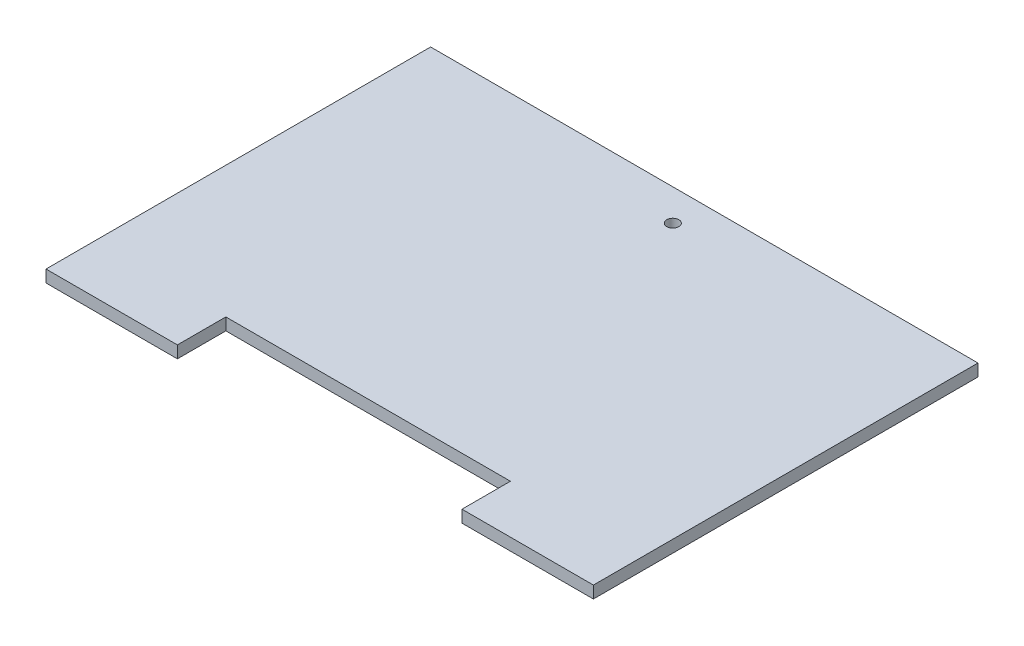
ISO-10303-21;
HEADER;
FILE_DESCRIPTION(('STEP AP214'),'2;1');
FILE_NAME('part.step','',(''),(''),'','','');
FILE_SCHEMA(('AUTOMOTIVE_DESIGN { 1 0 10303 214 1 1 1 1 }'));
ENDSEC;
DATA;
#1=APPLICATION_CONTEXT('core data for automotive mechanical design processes');
#2=APPLICATION_PROTOCOL_DEFINITION('international standard','automotive_design',2000,#1);
#3=PRODUCT_CONTEXT('',#1,'mechanical');
#4=PRODUCT('Part','Part','',(#3));
#5=PRODUCT_RELATED_PRODUCT_CATEGORY('part','',(#4));
#6=PRODUCT_DEFINITION_FORMATION('','',#4);
#7=PRODUCT_DEFINITION_CONTEXT('part definition',#1,'design');
#8=PRODUCT_DEFINITION('design','',#6,#7);
#9=PRODUCT_DEFINITION_SHAPE('','',#8);
#10=(LENGTH_UNIT() NAMED_UNIT(*) SI_UNIT(.MILLI.,.METRE.));
#11=(NAMED_UNIT(*) PLANE_ANGLE_UNIT() SI_UNIT($,.RADIAN.));
#12=(NAMED_UNIT(*) SI_UNIT($,.STERADIAN.) SOLID_ANGLE_UNIT());
#13=UNCERTAINTY_MEASURE_WITH_UNIT(LENGTH_MEASURE(1.E-05),#10,'distance_accuracy_value','');
#14=(GEOMETRIC_REPRESENTATION_CONTEXT(3) GLOBAL_UNCERTAINTY_ASSIGNED_CONTEXT((#13)) GLOBAL_UNIT_ASSIGNED_CONTEXT((#10,
#11,#12)) REPRESENTATION_CONTEXT('',''));
#15=CARTESIAN_POINT('',(0.,0.,0.));
#16=DIRECTION('',(0.,0.,1.));
#17=DIRECTION('',(1.,0.,0.));
#18=AXIS2_PLACEMENT_3D('',#15,#16,#17);
#19=CARTESIAN_POINT('',(-143.51,3.175,100.838));
#20=DIRECTION('',(0.,0.,-1.));
#21=DIRECTION('',(-1.,0.,0.));
#22=AXIS2_PLACEMENT_3D('',#19,#20,#21);
#23=PLANE('',#22);
#24=DIRECTION('',(1.,0.,0.));
#25=VECTOR('',#24,1.);
#26=CARTESIAN_POINT('',(-143.51,-3.175,100.838));
#27=LINE('',#26,#25);
#28=CARTESIAN_POINT('',(-143.51,-3.175,100.838));
#29=VERTEX_POINT('',#28);
#30=CARTESIAN_POINT('',(-74.6125,-3.175,100.838));
#31=VERTEX_POINT('',#30);
#32=EDGE_CURVE('E123',#29,#31,#27,.T.);
#33=ORIENTED_EDGE('',*,*,#32,.T.);
#34=DIRECTION('',(0.,1.,0.));
#35=VECTOR('',#34,1.);
#36=CARTESIAN_POINT('',(-74.6125,-3.175,100.838));
#37=LINE('',#36,#35);
#38=CARTESIAN_POINT('',(-74.6125,3.175,100.838));
#39=VERTEX_POINT('',#38);
#40=EDGE_CURVE('E151',#31,#39,#37,.T.);
#41=ORIENTED_EDGE('',*,*,#40,.T.);
#42=DIRECTION('',(1.,0.,0.));
#43=VECTOR('',#42,1.);
#44=CARTESIAN_POINT('',(-143.51,3.175,100.838));
#45=LINE('',#44,#43);
#46=CARTESIAN_POINT('',(-143.51,3.175,100.838));
#47=VERTEX_POINT('',#46);
#48=EDGE_CURVE('E135',#47,#39,#45,.T.);
#49=ORIENTED_EDGE('',*,*,#48,.F.);
#50=DIRECTION('',(0.,-1.,0.));
#51=VECTOR('',#50,1.);
#52=CARTESIAN_POINT('',(-143.51,3.175,100.838));
#53=LINE('',#52,#51);
#54=EDGE_CURVE('E134',#47,#29,#53,.T.);
#55=ORIENTED_EDGE('',*,*,#54,.T.);
#56=EDGE_LOOP('',(#33,#41,#49,#55));
#57=FACE_BOUND('',#56,.T.);
#58=ADVANCED_FACE('F34',(#57),#23,.F.);
#59=CARTESIAN_POINT('',(143.51,3.175,-100.838));
#60=DIRECTION('',(-1.,0.,0.));
#61=DIRECTION('',(0.,0.,1.));
#62=AXIS2_PLACEMENT_3D('',#59,#60,#61);
#63=PLANE('',#62);
#64=DIRECTION('',(0.,0.,-1.));
#65=VECTOR('',#64,1.);
#66=CARTESIAN_POINT('',(143.51,-3.175,-100.838));
#67=LINE('',#66,#65);
#68=CARTESIAN_POINT('',(143.51,-3.175,100.838));
#69=VERTEX_POINT('',#68);
#70=CARTESIAN_POINT('',(143.51,-3.175,-100.838));
#71=VERTEX_POINT('',#70);
#72=EDGE_CURVE('E122',#69,#71,#67,.T.);
#73=ORIENTED_EDGE('',*,*,#72,.T.);
#74=DIRECTION('',(0.,-1.,0.));
#75=VECTOR('',#74,1.);
#76=CARTESIAN_POINT('',(143.51,3.175,-100.838));
#77=LINE('',#76,#75);
#78=CARTESIAN_POINT('',(143.51,3.175,-100.838));
#79=VERTEX_POINT('',#78);
#80=EDGE_CURVE('E11',#79,#71,#77,.T.);
#81=ORIENTED_EDGE('',*,*,#80,.F.);
#82=DIRECTION('',(0.,0.,-1.));
#83=VECTOR('',#82,1.);
#84=CARTESIAN_POINT('',(143.51,3.175,-100.838));
#85=LINE('',#84,#83);
#86=CARTESIAN_POINT('',(143.51,3.175,100.838));
#87=VERTEX_POINT('',#86);
#88=EDGE_CURVE('E127',#87,#79,#85,.T.);
#89=ORIENTED_EDGE('',*,*,#88,.F.);
#90=DIRECTION('',(0.,-1.,0.));
#91=VECTOR('',#90,1.);
#92=CARTESIAN_POINT('',(143.51,3.175,100.838));
#93=LINE('',#92,#91);
#94=EDGE_CURVE('E132',#87,#69,#93,.T.);
#95=ORIENTED_EDGE('',*,*,#94,.T.);
#96=EDGE_LOOP('',(#73,#81,#89,#95));
#97=FACE_BOUND('',#96,.T.);
#98=ADVANCED_FACE('F36',(#97),#63,.F.);
#99=CARTESIAN_POINT('',(-143.51,3.175,-100.838));
#100=DIRECTION('',(0.,0.,1.));
#101=DIRECTION('',(1.,0.,0.));
#102=AXIS2_PLACEMENT_3D('',#99,#100,#101);
#103=PLANE('',#102);
#104=DIRECTION('',(-1.,0.,0.));
#105=VECTOR('',#104,1.);
#106=CARTESIAN_POINT('',(-143.51,-3.175,-100.838));
#107=LINE('',#106,#105);
#108=CARTESIAN_POINT('',(-143.51,-3.175,-100.838));
#109=VERTEX_POINT('',#108);
#110=EDGE_CURVE('E128',#71,#109,#107,.T.);
#111=ORIENTED_EDGE('',*,*,#110,.T.);
#112=DIRECTION('',(0.,-1.,0.));
#113=VECTOR('',#112,1.);
#114=CARTESIAN_POINT('',(-143.51,3.175,-100.838));
#115=LINE('',#114,#113);
#116=CARTESIAN_POINT('',(-143.51,3.175,-100.838));
#117=VERTEX_POINT('',#116);
#118=EDGE_CURVE('E43',#117,#109,#115,.T.);
#119=ORIENTED_EDGE('',*,*,#118,.F.);
#120=DIRECTION('',(-1.,0.,0.));
#121=VECTOR('',#120,1.);
#122=CARTESIAN_POINT('',(-143.51,3.175,-100.838));
#123=LINE('',#122,#121);
#124=EDGE_CURVE('E88',#79,#117,#123,.T.);
#125=ORIENTED_EDGE('',*,*,#124,.F.);
#126=ORIENTED_EDGE('',*,*,#80,.T.);
#127=EDGE_LOOP('',(#111,#119,#125,#126));
#128=FACE_BOUND('',#127,.T.);
#129=ADVANCED_FACE('F159',(#128),#103,.F.);
#130=CARTESIAN_POINT('',(-143.51,3.175,-100.838));
#131=DIRECTION('',(1.,0.,0.));
#132=DIRECTION('',(0.,0.,-1.));
#133=AXIS2_PLACEMENT_3D('',#130,#131,#132);
#134=PLANE('',#133);
#135=DIRECTION('',(0.,0.,1.));
#136=VECTOR('',#135,1.);
#137=CARTESIAN_POINT('',(-143.51,-3.175,-100.838));
#138=LINE('',#137,#136);
#139=EDGE_CURVE('E124',#109,#29,#138,.T.);
#140=ORIENTED_EDGE('',*,*,#139,.T.);
#141=ORIENTED_EDGE('',*,*,#54,.F.);
#142=DIRECTION('',(0.,0.,1.));
#143=VECTOR('',#142,1.);
#144=CARTESIAN_POINT('',(-143.51,3.175,-100.838));
#145=LINE('',#144,#143);
#146=EDGE_CURVE('E144',#117,#47,#145,.T.);
#147=ORIENTED_EDGE('',*,*,#146,.F.);
#148=ORIENTED_EDGE('',*,*,#118,.T.);
#149=EDGE_LOOP('',(#140,#141,#147,#148));
#150=FACE_BOUND('',#149,.T.);
#151=ADVANCED_FACE('F142',(#150),#134,.F.);
#152=CARTESIAN_POINT('',(74.6125,3.175,100.838));
#153=VERTEX_POINT('',#152);
#154=EDGE_CURVE('E59',#153,#87,#45,.T.);
#155=ORIENTED_EDGE('',*,*,#154,.F.);
#156=DIRECTION('',(0.,1.,0.));
#157=VECTOR('',#156,1.);
#158=CARTESIAN_POINT('',(74.6125,-3.175,100.838));
#159=LINE('',#158,#157);
#160=CARTESIAN_POINT('',(74.6125,-3.175,100.838));
#161=VERTEX_POINT('',#160);
#162=EDGE_CURVE('E112',#161,#153,#159,.T.);
#163=ORIENTED_EDGE('',*,*,#162,.F.);
#164=EDGE_CURVE('E81',#161,#69,#27,.T.);
#165=ORIENTED_EDGE('',*,*,#164,.T.);
#166=ORIENTED_EDGE('',*,*,#94,.F.);
#167=EDGE_LOOP('',(#155,#163,#165,#166));
#168=FACE_BOUND('',#167,.T.);
#169=ADVANCED_FACE('F116',(#168),#23,.F.);
#170=CARTESIAN_POINT('',(0.,3.175,0.));
#171=DIRECTION('',(0.,1.,0.));
#172=DIRECTION('',(0.,0.,1.));
#173=AXIS2_PLACEMENT_3D('',#170,#171,#172);
#174=PLANE('',#173);
#175=CARTESIAN_POINT('',(0.,3.175,-84.328));
#176=DIRECTION('',(0.,-1.,0.));
#177=DIRECTION('',(0.,0.,-1.));
#178=AXIS2_PLACEMENT_3D('',#175,#176,#177);
#179=CIRCLE('',#178,3.175);
#180=CARTESIAN_POINT('',(0.,3.175,-87.503));
#181=VERTEX_POINT('',#180);
#182=EDGE_CURVE('E177',#181,#181,#179,.T.);
#183=ORIENTED_EDGE('',*,*,#182,.T.);
#184=EDGE_LOOP('',(#183));
#185=FACE_BOUND('',#184,.T.);
#186=DIRECTION('',(0.,0.,1.));
#187=VECTOR('',#186,1.);
#188=CARTESIAN_POINT('',(-74.6125,3.175,0.));
#189=LINE('',#188,#187);
#190=CARTESIAN_POINT('',(-74.6125,3.175,75.438));
#191=VERTEX_POINT('',#190);
#192=EDGE_CURVE('E158',#191,#39,#189,.T.);
#193=ORIENTED_EDGE('',*,*,#192,.F.);
#194=DIRECTION('',(-1.,0.,0.));
#195=VECTOR('',#194,1.);
#196=CARTESIAN_POINT('',(0.,3.175,75.438));
#197=LINE('',#196,#195);
#198=CARTESIAN_POINT('',(74.6125,3.175,75.438));
#199=VERTEX_POINT('',#198);
#200=EDGE_CURVE('E166',#199,#191,#197,.T.);
#201=ORIENTED_EDGE('',*,*,#200,.F.);
#202=DIRECTION('',(0.,0.,-1.));
#203=VECTOR('',#202,1.);
#204=CARTESIAN_POINT('',(74.6125,3.175,0.));
#205=LINE('',#204,#203);
#206=EDGE_CURVE('E168',#153,#199,#205,.T.);
#207=ORIENTED_EDGE('',*,*,#206,.F.);
#208=ORIENTED_EDGE('',*,*,#154,.T.);
#209=ORIENTED_EDGE('',*,*,#88,.T.);
#210=ORIENTED_EDGE('',*,*,#124,.T.);
#211=ORIENTED_EDGE('',*,*,#146,.T.);
#212=ORIENTED_EDGE('',*,*,#48,.T.);
#213=EDGE_LOOP('',(#193,#201,#207,#208,#209,#210,#211,#212));
#214=FACE_BOUND('',#213,.T.);
#215=ADVANCED_FACE('F203',(#185,#214),#174,.T.);
#216=CARTESIAN_POINT('',(0.,-3.175,0.));
#217=DIRECTION('',(0.,1.,0.));
#218=DIRECTION('',(0.,0.,1.));
#219=AXIS2_PLACEMENT_3D('',#216,#217,#218);
#220=PLANE('',#219);
#221=CARTESIAN_POINT('',(0.,-3.175,-84.328));
#222=DIRECTION('',(0.,1.,0.));
#223=DIRECTION('',(0.,0.,1.));
#224=AXIS2_PLACEMENT_3D('',#221,#222,#223);
#225=CIRCLE('',#224,3.175);
#226=CARTESIAN_POINT('',(0.,-3.175,-81.153));
#227=VERTEX_POINT('',#226);
#228=EDGE_CURVE('E38',#227,#227,#225,.T.);
#229=ORIENTED_EDGE('',*,*,#228,.T.);
#230=EDGE_LOOP('',(#229));
#231=FACE_BOUND('',#230,.T.);
#232=DIRECTION('',(-1.,0.,0.));
#233=VECTOR('',#232,1.);
#234=CARTESIAN_POINT('',(-74.6125,-3.175,75.438));
#235=LINE('',#234,#233);
#236=CARTESIAN_POINT('',(74.6125,-3.175,75.438));
#237=VERTEX_POINT('',#236);
#238=CARTESIAN_POINT('',(-74.6125,-3.175,75.438));
#239=VERTEX_POINT('',#238);
#240=EDGE_CURVE('E50',#237,#239,#235,.T.);
#241=ORIENTED_EDGE('',*,*,#240,.T.);
#242=DIRECTION('',(0.,0.,1.));
#243=VECTOR('',#242,1.);
#244=CARTESIAN_POINT('',(-74.6125,-3.175,100.838));
#245=LINE('',#244,#243);
#246=EDGE_CURVE('E117',#239,#31,#245,.T.);
#247=ORIENTED_EDGE('',*,*,#246,.T.);
#248=ORIENTED_EDGE('',*,*,#32,.F.);
#249=ORIENTED_EDGE('',*,*,#139,.F.);
#250=ORIENTED_EDGE('',*,*,#110,.F.);
#251=ORIENTED_EDGE('',*,*,#72,.F.);
#252=ORIENTED_EDGE('',*,*,#164,.F.);
#253=DIRECTION('',(0.,0.,-1.));
#254=VECTOR('',#253,1.);
#255=CARTESIAN_POINT('',(74.6125,-3.175,75.438));
#256=LINE('',#255,#254);
#257=EDGE_CURVE('E110',#161,#237,#256,.T.);
#258=ORIENTED_EDGE('',*,*,#257,.T.);
#259=EDGE_LOOP('',(#241,#247,#248,#249,#250,#251,#252,#258));
#260=FACE_BOUND('',#259,.T.);
#261=ADVANCED_FACE('F120',(#231,#260),#220,.F.);
#262=CARTESIAN_POINT('',(-74.6125,-3.175,100.838));
#263=DIRECTION('',(-1.,0.,0.));
#264=DIRECTION('',(0.,0.,1.));
#265=AXIS2_PLACEMENT_3D('',#262,#263,#264);
#266=PLANE('',#265);
#267=ORIENTED_EDGE('',*,*,#192,.T.);
#268=ORIENTED_EDGE('',*,*,#40,.F.);
#269=ORIENTED_EDGE('',*,*,#246,.F.);
#270=DIRECTION('',(0.,1.,0.));
#271=VECTOR('',#270,1.);
#272=CARTESIAN_POINT('',(-74.6125,-3.175,75.438));
#273=LINE('',#272,#271);
#274=EDGE_CURVE('E171',#239,#191,#273,.T.);
#275=ORIENTED_EDGE('',*,*,#274,.T.);
#276=EDGE_LOOP('',(#267,#268,#269,#275));
#277=FACE_BOUND('',#276,.T.);
#278=ADVANCED_FACE('F245',(#277),#266,.F.);
#279=CARTESIAN_POINT('',(-74.6125,-3.175,75.438));
#280=DIRECTION('',(0.,0.,-1.));
#281=DIRECTION('',(-1.,0.,0.));
#282=AXIS2_PLACEMENT_3D('',#279,#280,#281);
#283=PLANE('',#282);
#284=ORIENTED_EDGE('',*,*,#200,.T.);
#285=ORIENTED_EDGE('',*,*,#274,.F.);
#286=ORIENTED_EDGE('',*,*,#240,.F.);
#287=DIRECTION('',(0.,1.,0.));
#288=VECTOR('',#287,1.);
#289=CARTESIAN_POINT('',(74.6125,-3.175,75.438));
#290=LINE('',#289,#288);
#291=EDGE_CURVE('E113',#237,#199,#290,.T.);
#292=ORIENTED_EDGE('',*,*,#291,.T.);
#293=EDGE_LOOP('',(#284,#285,#286,#292));
#294=FACE_BOUND('',#293,.T.);
#295=ADVANCED_FACE('F192',(#294),#283,.F.);
#296=CARTESIAN_POINT('',(74.6125,-3.175,75.438));
#297=DIRECTION('',(1.,0.,0.));
#298=DIRECTION('',(0.,0.,-1.));
#299=AXIS2_PLACEMENT_3D('',#296,#297,#298);
#300=PLANE('',#299);
#301=ORIENTED_EDGE('',*,*,#206,.T.);
#302=ORIENTED_EDGE('',*,*,#291,.F.);
#303=ORIENTED_EDGE('',*,*,#257,.F.);
#304=ORIENTED_EDGE('',*,*,#162,.T.);
#305=EDGE_LOOP('',(#301,#302,#303,#304));
#306=FACE_BOUND('',#305,.T.);
#307=ADVANCED_FACE('F111',(#306),#300,.F.);
#308=CARTESIAN_POINT('',(0.,3.175,-84.328));
#309=DIRECTION('',(0.,-1.,0.));
#310=DIRECTION('',(0.,0.,-1.));
#311=AXIS2_PLACEMENT_3D('',#308,#309,#310);
#312=CYLINDRICAL_SURFACE('',#311,3.175);
#313=ORIENTED_EDGE('',*,*,#182,.F.);
#314=EDGE_LOOP('',(#313));
#315=FACE_BOUND('',#314,.T.);
#316=ORIENTED_EDGE('',*,*,#228,.F.);
#317=EDGE_LOOP('',(#316));
#318=FACE_BOUND('',#317,.T.);
#319=ADVANCED_FACE('F185',(#315,#318),#312,.F.);
#320=CLOSED_SHELL('',(#58,#98,#129,#151,#169,#215,#261,#278,#295,#307,#319));
#321=MANIFOLD_SOLID_BREP('B2',#320);
#322=ADVANCED_BREP_SHAPE_REPRESENTATION('',(#18,#321),#14);
#323=SHAPE_DEFINITION_REPRESENTATION(#9,#322);
ENDSEC;
END-ISO-10303-21;
